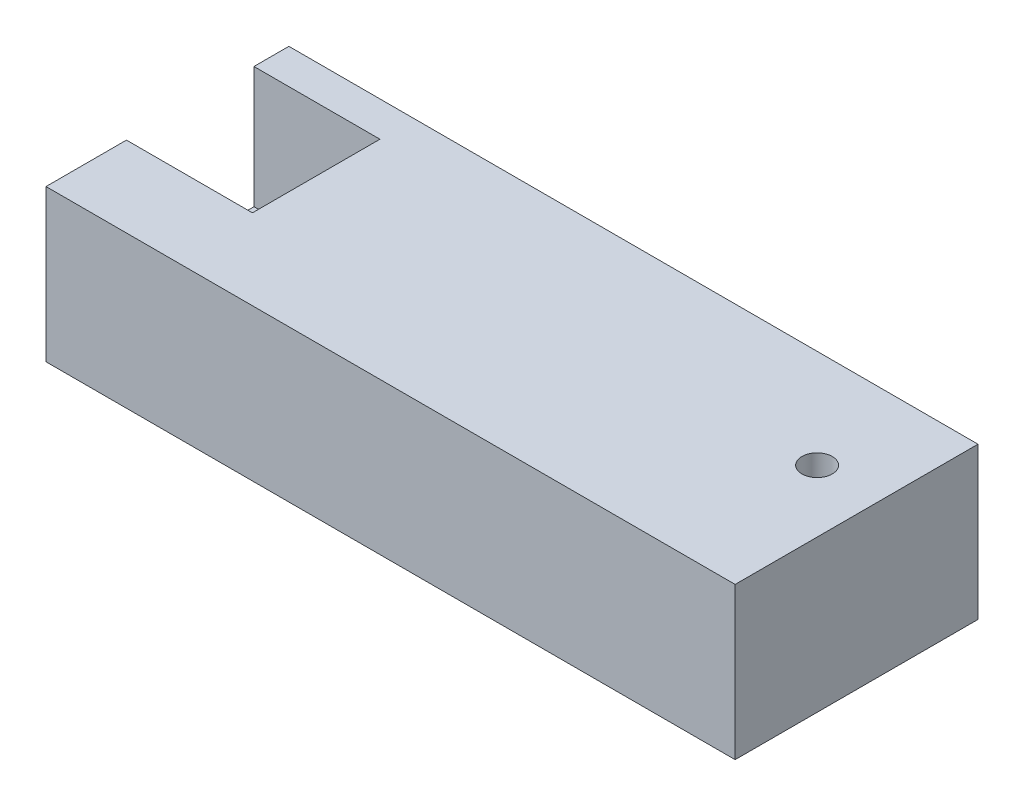
ISO-10303-21;
HEADER;
FILE_DESCRIPTION(('STEP AP214'),'2;1');
FILE_NAME('part.step','',(''),(''),'','','');
FILE_SCHEMA(('AUTOMOTIVE_DESIGN { 1 0 10303 214 1 1 1 1 }'));
ENDSEC;
DATA;
#1=APPLICATION_CONTEXT('core data for automotive mechanical design processes');
#2=APPLICATION_PROTOCOL_DEFINITION('international standard','automotive_design',2000,#1);
#3=PRODUCT_CONTEXT('',#1,'mechanical');
#4=PRODUCT('Part','Part','',(#3));
#5=PRODUCT_RELATED_PRODUCT_CATEGORY('part','',(#4));
#6=PRODUCT_DEFINITION_FORMATION('','',#4);
#7=PRODUCT_DEFINITION_CONTEXT('part definition',#1,'design');
#8=PRODUCT_DEFINITION('design','',#6,#7);
#9=PRODUCT_DEFINITION_SHAPE('','',#8);
#10=(LENGTH_UNIT() NAMED_UNIT(*) SI_UNIT(.MILLI.,.METRE.));
#11=(NAMED_UNIT(*) PLANE_ANGLE_UNIT() SI_UNIT($,.RADIAN.));
#12=(NAMED_UNIT(*) SI_UNIT($,.STERADIAN.) SOLID_ANGLE_UNIT());
#13=UNCERTAINTY_MEASURE_WITH_UNIT(LENGTH_MEASURE(1.E-05),#10,'distance_accuracy_value','');
#14=(GEOMETRIC_REPRESENTATION_CONTEXT(3) GLOBAL_UNCERTAINTY_ASSIGNED_CONTEXT((#13)) GLOBAL_UNIT_ASSIGNED_CONTEXT((#10,
#11,#12)) REPRESENTATION_CONTEXT('',''));
#15=CARTESIAN_POINT('',(0.,0.,0.));
#16=DIRECTION('',(0.,0.,1.));
#17=DIRECTION('',(1.,0.,0.));
#18=AXIS2_PLACEMENT_3D('',#15,#16,#17);
#19=CARTESIAN_POINT('',(0.,50.,0.));
#20=DIRECTION('',(0.,-1.,0.));
#21=DIRECTION('',(0.,0.,-1.));
#22=AXIS2_PLACEMENT_3D('',#19,#20,#21);
#23=PLANE('',#22);
#24=DIRECTION('',(0.,0.,-1.));
#25=VECTOR('',#24,1.);
#26=CARTESIAN_POINT('',(-72.,50.,13.5));
#27=LINE('',#26,#25);
#28=CARTESIAN_POINT('',(-72.,50.,13.5));
#29=VERTEX_POINT('',#28);
#30=CARTESIAN_POINT('',(-72.,50.,-28.5));
#31=VERTEX_POINT('',#30);
#32=EDGE_CURVE('E121',#29,#31,#27,.T.);
#33=ORIENTED_EDGE('',*,*,#32,.F.);
#34=DIRECTION('',(1.,0.,0.));
#35=VECTOR('',#34,1.);
#36=CARTESIAN_POINT('',(-114.,50.,13.5));
#37=LINE('',#36,#35);
#38=CARTESIAN_POINT('',(-113.5,50.,13.5));
#39=VERTEX_POINT('',#38);
#40=EDGE_CURVE('E137',#39,#29,#37,.T.);
#41=ORIENTED_EDGE('',*,*,#40,.F.);
#42=DIRECTION('',(0.,0.,1.));
#43=VECTOR('',#42,1.);
#44=CARTESIAN_POINT('',(-113.5,50.,40.));
#45=LINE('',#44,#43);
#46=CARTESIAN_POINT('',(-113.5,50.,40.));
#47=VERTEX_POINT('',#46);
#48=EDGE_CURVE('E173',#39,#47,#45,.T.);
#49=ORIENTED_EDGE('',*,*,#48,.T.);
#50=DIRECTION('',(1.,0.,0.));
#51=VECTOR('',#50,1.);
#52=CARTESIAN_POINT('',(-113.5,50.,40.));
#53=LINE('',#52,#51);
#54=CARTESIAN_POINT('',(113.5,50.,40.));
#55=VERTEX_POINT('',#54);
#56=EDGE_CURVE('E64',#47,#55,#53,.T.);
#57=ORIENTED_EDGE('',*,*,#56,.T.);
#58=DIRECTION('',(0.,0.,-1.));
#59=VECTOR('',#58,1.);
#60=CARTESIAN_POINT('',(113.5,50.,40.));
#61=LINE('',#60,#59);
#62=CARTESIAN_POINT('',(113.5,50.,-40.));
#63=VERTEX_POINT('',#62);
#64=EDGE_CURVE('E168',#55,#63,#61,.T.);
#65=ORIENTED_EDGE('',*,*,#64,.T.);
#66=DIRECTION('',(-1.,0.,0.));
#67=VECTOR('',#66,1.);
#68=CARTESIAN_POINT('',(-113.5,50.,-40.));
#69=LINE('',#68,#67);
#70=CARTESIAN_POINT('',(-113.5,50.,-40.));
#71=VERTEX_POINT('',#70);
#72=EDGE_CURVE('E93',#63,#71,#69,.T.);
#73=ORIENTED_EDGE('',*,*,#72,.T.);
#74=CARTESIAN_POINT('',(-113.5,50.,-28.5));
#75=VERTEX_POINT('',#74);
#76=EDGE_CURVE('E174',#71,#75,#45,.T.);
#77=ORIENTED_EDGE('',*,*,#76,.T.);
#78=DIRECTION('',(-1.,0.,0.));
#79=VECTOR('',#78,1.);
#80=CARTESIAN_POINT('',(-114.,50.,-28.5));
#81=LINE('',#80,#79);
#82=EDGE_CURVE('E140',#31,#75,#81,.T.);
#83=ORIENTED_EDGE('',*,*,#82,.F.);
#84=EDGE_LOOP('',(#33,#41,#49,#57,#65,#73,#77,#83));
#85=FACE_BOUND('',#84,.T.);
#86=CARTESIAN_POINT('',(93.,50.,-7.49999999999999));
#87=DIRECTION('',(0.,1.,0.));
#88=DIRECTION('',(0.,0.,1.));
#89=AXIS2_PLACEMENT_3D('',#86,#87,#88);
#90=CIRCLE('',#89,5.);
#91=CARTESIAN_POINT('',(93.,50.,-2.49999999999999));
#92=VERTEX_POINT('',#91);
#93=EDGE_CURVE('E156',#92,#92,#90,.T.);
#94=ORIENTED_EDGE('',*,*,#93,.F.);
#95=EDGE_LOOP('',(#94));
#96=FACE_BOUND('',#95,.T.);
#97=ADVANCED_FACE('F39',(#85,#96),#23,.F.);
#98=CARTESIAN_POINT('',(0.,0.,0.));
#99=DIRECTION('',(0.,-1.,0.));
#100=DIRECTION('',(0.,0.,-1.));
#101=AXIS2_PLACEMENT_3D('',#98,#99,#100);
#102=PLANE('',#101);
#103=CARTESIAN_POINT('',(-93.,0.,-7.49999999999999));
#104=DIRECTION('',(0.,1.,0.));
#105=DIRECTION('',(0.,0.,1.));
#106=AXIS2_PLACEMENT_3D('',#103,#104,#105);
#107=CIRCLE('',#106,5.);
#108=CARTESIAN_POINT('',(-93.,0.,-2.49999999999999));
#109=VERTEX_POINT('',#108);
#110=EDGE_CURVE('E160',#109,#109,#107,.T.);
#111=ORIENTED_EDGE('',*,*,#110,.T.);
#112=EDGE_LOOP('',(#111));
#113=FACE_BOUND('',#112,.T.);
#114=DIRECTION('',(0.,0.,-1.));
#115=VECTOR('',#114,1.);
#116=CARTESIAN_POINT('',(113.5,0.,40.));
#117=LINE('',#116,#115);
#118=CARTESIAN_POINT('',(113.5,0.,40.));
#119=VERTEX_POINT('',#118);
#120=CARTESIAN_POINT('',(113.5,0.,-40.));
#121=VERTEX_POINT('',#120);
#122=EDGE_CURVE('E167',#119,#121,#117,.T.);
#123=ORIENTED_EDGE('',*,*,#122,.F.);
#124=DIRECTION('',(1.,0.,0.));
#125=VECTOR('',#124,1.);
#126=CARTESIAN_POINT('',(-113.5,0.,40.));
#127=LINE('',#126,#125);
#128=CARTESIAN_POINT('',(-113.5,0.,40.));
#129=VERTEX_POINT('',#128);
#130=EDGE_CURVE('E85',#129,#119,#127,.T.);
#131=ORIENTED_EDGE('',*,*,#130,.F.);
#132=DIRECTION('',(0.,0.,1.));
#133=VECTOR('',#132,1.);
#134=CARTESIAN_POINT('',(-113.5,0.,40.));
#135=LINE('',#134,#133);
#136=CARTESIAN_POINT('',(-113.5,0.,-40.));
#137=VERTEX_POINT('',#136);
#138=EDGE_CURVE('E187',#137,#129,#135,.T.);
#139=ORIENTED_EDGE('',*,*,#138,.F.);
#140=DIRECTION('',(-1.,0.,0.));
#141=VECTOR('',#140,1.);
#142=CARTESIAN_POINT('',(-113.5,0.,-40.));
#143=LINE('',#142,#141);
#144=EDGE_CURVE('E184',#121,#137,#143,.T.);
#145=ORIENTED_EDGE('',*,*,#144,.F.);
#146=EDGE_LOOP('',(#123,#131,#139,#145));
#147=FACE_BOUND('',#146,.T.);
#148=CARTESIAN_POINT('',(93.,0.,-7.49999999999999));
#149=DIRECTION('',(0.,1.,0.));
#150=DIRECTION('',(0.,0.,1.));
#151=AXIS2_PLACEMENT_3D('',#148,#149,#150);
#152=CIRCLE('',#151,5.);
#153=CARTESIAN_POINT('',(93.,0.,-2.49999999999999));
#154=VERTEX_POINT('',#153);
#155=EDGE_CURVE('E155',#154,#154,#152,.T.);
#156=ORIENTED_EDGE('',*,*,#155,.T.);
#157=EDGE_LOOP('',(#156));
#158=FACE_BOUND('',#157,.T.);
#159=ADVANCED_FACE('F219',(#113,#147,#158),#102,.T.);
#160=CARTESIAN_POINT('',(113.5,50.,40.));
#161=DIRECTION('',(-1.,0.,0.));
#162=DIRECTION('',(0.,0.,1.));
#163=AXIS2_PLACEMENT_3D('',#160,#161,#162);
#164=PLANE('',#163);
#165=ORIENTED_EDGE('',*,*,#122,.T.);
#166=DIRECTION('',(0.,-1.,0.));
#167=VECTOR('',#166,1.);
#168=CARTESIAN_POINT('',(113.5,50.,-40.));
#169=LINE('',#168,#167);
#170=EDGE_CURVE('E201',#63,#121,#169,.T.);
#171=ORIENTED_EDGE('',*,*,#170,.F.);
#172=ORIENTED_EDGE('',*,*,#64,.F.);
#173=DIRECTION('',(0.,-1.,0.));
#174=VECTOR('',#173,1.);
#175=CARTESIAN_POINT('',(113.5,50.,40.));
#176=LINE('',#175,#174);
#177=EDGE_CURVE('E180',#55,#119,#176,.T.);
#178=ORIENTED_EDGE('',*,*,#177,.T.);
#179=EDGE_LOOP('',(#165,#171,#172,#178));
#180=FACE_BOUND('',#179,.T.);
#181=ADVANCED_FACE('F41',(#180),#164,.F.);
#182=CARTESIAN_POINT('',(-113.5,50.,-40.));
#183=DIRECTION('',(0.,0.,1.));
#184=DIRECTION('',(1.,0.,0.));
#185=AXIS2_PLACEMENT_3D('',#182,#183,#184);
#186=PLANE('',#185);
#187=ORIENTED_EDGE('',*,*,#144,.T.);
#188=DIRECTION('',(0.,-1.,0.));
#189=VECTOR('',#188,1.);
#190=CARTESIAN_POINT('',(-113.5,50.,-40.));
#191=LINE('',#190,#189);
#192=EDGE_CURVE('E197',#71,#137,#191,.T.);
#193=ORIENTED_EDGE('',*,*,#192,.F.);
#194=ORIENTED_EDGE('',*,*,#72,.F.);
#195=ORIENTED_EDGE('',*,*,#170,.T.);
#196=EDGE_LOOP('',(#187,#193,#194,#195));
#197=FACE_BOUND('',#196,.T.);
#198=ADVANCED_FACE('F214',(#197),#186,.F.);
#199=CARTESIAN_POINT('',(-113.5,50.,40.));
#200=DIRECTION('',(1.,0.,0.));
#201=DIRECTION('',(0.,0.,-1.));
#202=AXIS2_PLACEMENT_3D('',#199,#200,#201);
#203=PLANE('',#202);
#204=ORIENTED_EDGE('',*,*,#48,.F.);
#205=DIRECTION('',(0.,-1.,0.));
#206=VECTOR('',#205,1.);
#207=CARTESIAN_POINT('',(-113.5,50.,13.5));
#208=LINE('',#207,#206);
#209=CARTESIAN_POINT('',(-113.5,10.,13.5));
#210=VERTEX_POINT('',#209);
#211=EDGE_CURVE('E11',#39,#210,#208,.T.);
#212=ORIENTED_EDGE('',*,*,#211,.T.);
#213=DIRECTION('',(0.,0.,-1.));
#214=VECTOR('',#213,1.);
#215=CARTESIAN_POINT('',(-113.5,10.,40.));
#216=LINE('',#215,#214);
#217=CARTESIAN_POINT('',(-113.5,10.,-28.5));
#218=VERTEX_POINT('',#217);
#219=EDGE_CURVE('E152',#210,#218,#216,.T.);
#220=ORIENTED_EDGE('',*,*,#219,.T.);
#221=DIRECTION('',(0.,1.,0.));
#222=VECTOR('',#221,1.);
#223=CARTESIAN_POINT('',(-113.5,50.,-28.5));
#224=LINE('',#223,#222);
#225=EDGE_CURVE('E48',#218,#75,#224,.T.);
#226=ORIENTED_EDGE('',*,*,#225,.T.);
#227=ORIENTED_EDGE('',*,*,#76,.F.);
#228=ORIENTED_EDGE('',*,*,#192,.T.);
#229=ORIENTED_EDGE('',*,*,#138,.T.);
#230=DIRECTION('',(0.,-1.,0.));
#231=VECTOR('',#230,1.);
#232=CARTESIAN_POINT('',(-113.5,50.,40.));
#233=LINE('',#232,#231);
#234=EDGE_CURVE('E194',#47,#129,#233,.T.);
#235=ORIENTED_EDGE('',*,*,#234,.F.);
#236=EDGE_LOOP('',(#204,#212,#220,#226,#227,#228,#229,#235));
#237=FACE_BOUND('',#236,.T.);
#238=ADVANCED_FACE('F210',(#237),#203,.F.);
#239=CARTESIAN_POINT('',(-113.5,50.,40.));
#240=DIRECTION('',(0.,0.,-1.));
#241=DIRECTION('',(-1.,0.,0.));
#242=AXIS2_PLACEMENT_3D('',#239,#240,#241);
#243=PLANE('',#242);
#244=ORIENTED_EDGE('',*,*,#130,.T.);
#245=ORIENTED_EDGE('',*,*,#177,.F.);
#246=ORIENTED_EDGE('',*,*,#56,.F.);
#247=ORIENTED_EDGE('',*,*,#234,.T.);
#248=EDGE_LOOP('',(#244,#245,#246,#247));
#249=FACE_BOUND('',#248,.T.);
#250=ADVANCED_FACE('F222',(#249),#243,.F.);
#251=CARTESIAN_POINT('',(-93.,50.,-7.49999999999999));
#252=DIRECTION('',(0.,-1.,0.));
#253=DIRECTION('',(0.,0.,-1.));
#254=AXIS2_PLACEMENT_3D('',#251,#252,#253);
#255=CYLINDRICAL_SURFACE('',#254,5.);
#256=CARTESIAN_POINT('',(-93.,10.,-7.49999999999999));
#257=DIRECTION('',(0.,-1.,0.));
#258=DIRECTION('',(0.,0.,-1.));
#259=AXIS2_PLACEMENT_3D('',#256,#257,#258);
#260=CIRCLE('',#259,5.);
#261=CARTESIAN_POINT('',(-93.,10.,-12.5));
#262=VERTEX_POINT('',#261);
#263=EDGE_CURVE('E150',#262,#262,#260,.T.);
#264=ORIENTED_EDGE('',*,*,#263,.F.);
#265=EDGE_LOOP('',(#264));
#266=FACE_BOUND('',#265,.T.);
#267=ORIENTED_EDGE('',*,*,#110,.F.);
#268=EDGE_LOOP('',(#267));
#269=FACE_BOUND('',#268,.T.);
#270=ADVANCED_FACE('F235',(#266,#269),#255,.F.);
#271=CARTESIAN_POINT('',(93.,50.,-7.49999999999999));
#272=DIRECTION('',(0.,-1.,0.));
#273=DIRECTION('',(0.,0.,-1.));
#274=AXIS2_PLACEMENT_3D('',#271,#272,#273);
#275=CYLINDRICAL_SURFACE('',#274,5.);
#276=ORIENTED_EDGE('',*,*,#93,.T.);
#277=EDGE_LOOP('',(#276));
#278=FACE_BOUND('',#277,.T.);
#279=ORIENTED_EDGE('',*,*,#155,.F.);
#280=EDGE_LOOP('',(#279));
#281=FACE_BOUND('',#280,.T.);
#282=ADVANCED_FACE('F228',(#278,#281),#275,.F.);
#283=CARTESIAN_POINT('',(-114.,10.,13.5));
#284=DIRECTION('',(0.,0.,1.));
#285=DIRECTION('',(1.,0.,0.));
#286=AXIS2_PLACEMENT_3D('',#283,#284,#285);
#287=PLANE('',#286);
#288=ORIENTED_EDGE('',*,*,#40,.T.);
#289=DIRECTION('',(0.,1.,0.));
#290=VECTOR('',#289,1.);
#291=CARTESIAN_POINT('',(-72.,10.,13.5));
#292=LINE('',#291,#290);
#293=CARTESIAN_POINT('',(-72.,10.,13.5));
#294=VERTEX_POINT('',#293);
#295=EDGE_CURVE('E125',#294,#29,#292,.T.);
#296=ORIENTED_EDGE('',*,*,#295,.F.);
#297=DIRECTION('',(1.,0.,0.));
#298=VECTOR('',#297,1.);
#299=CARTESIAN_POINT('',(-114.,10.,13.5));
#300=LINE('',#299,#298);
#301=EDGE_CURVE('E126',#210,#294,#300,.T.);
#302=ORIENTED_EDGE('',*,*,#301,.F.);
#303=ORIENTED_EDGE('',*,*,#211,.F.);
#304=EDGE_LOOP('',(#288,#296,#302,#303));
#305=FACE_BOUND('',#304,.T.);
#306=ADVANCED_FACE('F226',(#305),#287,.F.);
#307=CARTESIAN_POINT('',(-114.,10.,-28.5));
#308=DIRECTION('',(0.,0.,-1.));
#309=DIRECTION('',(-1.,0.,0.));
#310=AXIS2_PLACEMENT_3D('',#307,#308,#309);
#311=PLANE('',#310);
#312=DIRECTION('',(-1.,0.,0.));
#313=VECTOR('',#312,1.);
#314=CARTESIAN_POINT('',(-114.,10.,-28.5));
#315=LINE('',#314,#313);
#316=CARTESIAN_POINT('',(-72.,10.,-28.5));
#317=VERTEX_POINT('',#316);
#318=EDGE_CURVE('E55',#317,#218,#315,.T.);
#319=ORIENTED_EDGE('',*,*,#318,.F.);
#320=DIRECTION('',(0.,1.,0.));
#321=VECTOR('',#320,1.);
#322=CARTESIAN_POINT('',(-72.,10.,-28.5));
#323=LINE('',#322,#321);
#324=EDGE_CURVE('E116',#317,#31,#323,.T.);
#325=ORIENTED_EDGE('',*,*,#324,.T.);
#326=ORIENTED_EDGE('',*,*,#82,.T.);
#327=ORIENTED_EDGE('',*,*,#225,.F.);
#328=EDGE_LOOP('',(#319,#325,#326,#327));
#329=FACE_BOUND('',#328,.T.);
#330=ADVANCED_FACE('F128',(#329),#311,.F.);
#331=CARTESIAN_POINT('',(0.,10.,0.));
#332=DIRECTION('',(0.,-1.,0.));
#333=DIRECTION('',(0.,0.,-1.));
#334=AXIS2_PLACEMENT_3D('',#331,#332,#333);
#335=PLANE('',#334);
#336=ORIENTED_EDGE('',*,*,#263,.T.);
#337=EDGE_LOOP('',(#336));
#338=FACE_BOUND('',#337,.T.);
#339=ORIENTED_EDGE('',*,*,#301,.T.);
#340=DIRECTION('',(0.,0.,-1.));
#341=VECTOR('',#340,1.);
#342=CARTESIAN_POINT('',(-72.,10.,13.5));
#343=LINE('',#342,#341);
#344=EDGE_CURVE('E119',#294,#317,#343,.T.);
#345=ORIENTED_EDGE('',*,*,#344,.T.);
#346=ORIENTED_EDGE('',*,*,#318,.T.);
#347=ORIENTED_EDGE('',*,*,#219,.F.);
#348=EDGE_LOOP('',(#339,#345,#346,#347));
#349=FACE_BOUND('',#348,.T.);
#350=ADVANCED_FACE('F133',(#338,#349),#335,.F.);
#351=CARTESIAN_POINT('',(-72.,10.,13.5));
#352=DIRECTION('',(1.,0.,0.));
#353=DIRECTION('',(0.,0.,-1.));
#354=AXIS2_PLACEMENT_3D('',#351,#352,#353);
#355=PLANE('',#354);
#356=ORIENTED_EDGE('',*,*,#32,.T.);
#357=ORIENTED_EDGE('',*,*,#324,.F.);
#358=ORIENTED_EDGE('',*,*,#344,.F.);
#359=ORIENTED_EDGE('',*,*,#295,.T.);
#360=EDGE_LOOP('',(#356,#357,#358,#359));
#361=FACE_BOUND('',#360,.T.);
#362=ADVANCED_FACE('F117',(#361),#355,.F.);
#363=CLOSED_SHELL('',(#97,#159,#181,#198,#238,#250,#270,#282,#306,#330,#350,#362));
#364=MANIFOLD_SOLID_BREP('B2',#363);
#365=ADVANCED_BREP_SHAPE_REPRESENTATION('',(#18,#364),#14);
#366=SHAPE_DEFINITION_REPRESENTATION(#9,#365);
ENDSEC;
END-ISO-10303-21;
